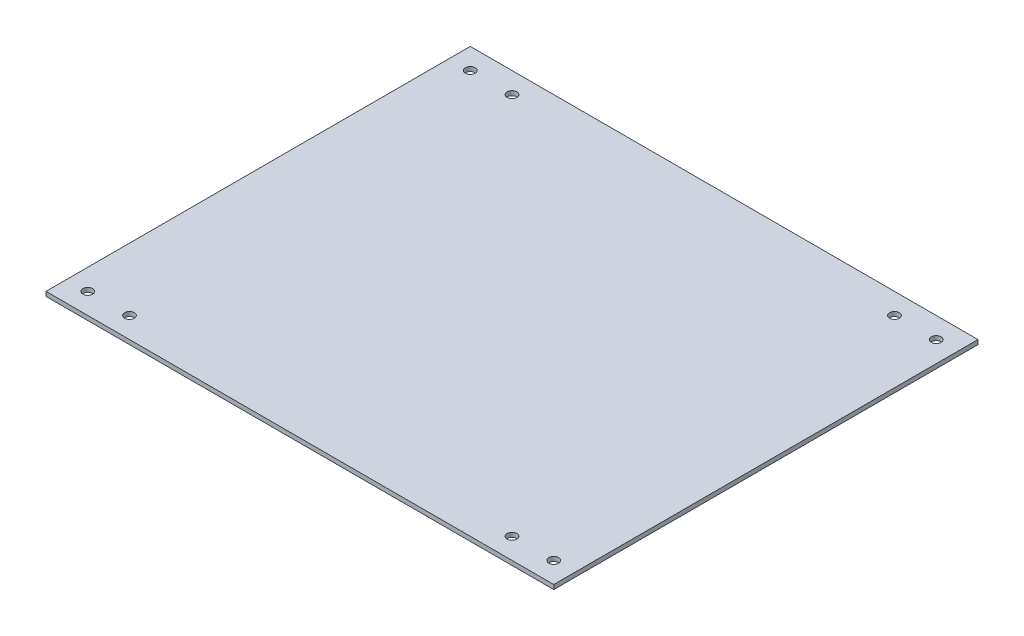
ISO-10303-21;
HEADER;
FILE_DESCRIPTION(('STEP AP214'),'2;1');
FILE_NAME('part.step','',(''),(''),'','','');
FILE_SCHEMA(('AUTOMOTIVE_DESIGN { 1 0 10303 214 1 1 1 1 }'));
ENDSEC;
DATA;
#1=APPLICATION_CONTEXT('core data for automotive mechanical design processes');
#2=APPLICATION_PROTOCOL_DEFINITION('international standard','automotive_design',2000,#1);
#3=PRODUCT_CONTEXT('',#1,'mechanical');
#4=PRODUCT('Part','Part','',(#3));
#5=PRODUCT_RELATED_PRODUCT_CATEGORY('part','',(#4));
#6=PRODUCT_DEFINITION_FORMATION('','',#4);
#7=PRODUCT_DEFINITION_CONTEXT('part definition',#1,'design');
#8=PRODUCT_DEFINITION('design','',#6,#7);
#9=PRODUCT_DEFINITION_SHAPE('','',#8);
#10=(LENGTH_UNIT() NAMED_UNIT(*) SI_UNIT(.MILLI.,.METRE.));
#11=(NAMED_UNIT(*) PLANE_ANGLE_UNIT() SI_UNIT($,.RADIAN.));
#12=(NAMED_UNIT(*) SI_UNIT($,.STERADIAN.) SOLID_ANGLE_UNIT());
#13=UNCERTAINTY_MEASURE_WITH_UNIT(LENGTH_MEASURE(1.E-05),#10,'distance_accuracy_value','');
#14=(GEOMETRIC_REPRESENTATION_CONTEXT(3) GLOBAL_UNCERTAINTY_ASSIGNED_CONTEXT((#13)) GLOBAL_UNIT_ASSIGNED_CONTEXT((#10,
#11,#12)) REPRESENTATION_CONTEXT('',''));
#15=CARTESIAN_POINT('',(0.,0.,0.));
#16=DIRECTION('',(0.,0.,1.));
#17=DIRECTION('',(1.,0.,0.));
#18=AXIS2_PLACEMENT_3D('',#15,#16,#17);
#19=CARTESIAN_POINT('',(0.,3.175,0.));
#20=DIRECTION('',(1.,0.,0.));
#21=DIRECTION('',(0.,0.,-1.));
#22=AXIS2_PLACEMENT_3D('',#19,#20,#21);
#23=PLANE('',#22);
#24=DIRECTION('',(0.,0.,1.));
#25=VECTOR('',#24,1.);
#26=CARTESIAN_POINT('',(0.,0.,0.));
#27=LINE('',#26,#25);
#28=CARTESIAN_POINT('',(0.,0.,-304.8));
#29=VERTEX_POINT('',#28);
#30=CARTESIAN_POINT('',(0.,0.,0.));
#31=VERTEX_POINT('',#30);
#32=EDGE_CURVE('E113',#29,#31,#27,.T.);
#33=ORIENTED_EDGE('',*,*,#32,.T.);
#34=DIRECTION('',(0.,-1.,0.));
#35=VECTOR('',#34,1.);
#36=CARTESIAN_POINT('',(0.,3.175,0.));
#37=LINE('',#36,#35);
#38=CARTESIAN_POINT('',(0.,3.175,0.));
#39=VERTEX_POINT('',#38);
#40=EDGE_CURVE('E11',#39,#31,#37,.T.);
#41=ORIENTED_EDGE('',*,*,#40,.F.);
#42=DIRECTION('',(0.,0.,1.));
#43=VECTOR('',#42,1.);
#44=CARTESIAN_POINT('',(0.,3.175,0.));
#45=LINE('',#44,#43);
#46=CARTESIAN_POINT('',(0.,3.175,-304.8));
#47=VERTEX_POINT('',#46);
#48=EDGE_CURVE('E97',#47,#39,#45,.T.);
#49=ORIENTED_EDGE('',*,*,#48,.F.);
#50=DIRECTION('',(0.,-1.,0.));
#51=VECTOR('',#50,1.);
#52=CARTESIAN_POINT('',(0.,3.175,-304.8));
#53=LINE('',#52,#51);
#54=EDGE_CURVE('E109',#47,#29,#53,.T.);
#55=ORIENTED_EDGE('',*,*,#54,.T.);
#56=EDGE_LOOP('',(#33,#41,#49,#55));
#57=FACE_BOUND('',#56,.T.);
#58=ADVANCED_FACE('F45',(#57),#23,.F.);
#59=CARTESIAN_POINT('',(0.,3.175,0.));
#60=DIRECTION('',(0.,0.,-1.));
#61=DIRECTION('',(-1.,0.,0.));
#62=AXIS2_PLACEMENT_3D('',#59,#60,#61);
#63=PLANE('',#62);
#64=DIRECTION('',(1.,0.,0.));
#65=VECTOR('',#64,1.);
#66=CARTESIAN_POINT('',(0.,0.,0.));
#67=LINE('',#66,#65);
#68=CARTESIAN_POINT('',(364.8,0.,0.));
#69=VERTEX_POINT('',#68);
#70=EDGE_CURVE('E102',#31,#69,#67,.T.);
#71=ORIENTED_EDGE('',*,*,#70,.T.);
#72=DIRECTION('',(0.,-1.,0.));
#73=VECTOR('',#72,1.);
#74=CARTESIAN_POINT('',(364.8,3.175,0.));
#75=LINE('',#74,#73);
#76=CARTESIAN_POINT('',(364.8,3.175,0.));
#77=VERTEX_POINT('',#76);
#78=EDGE_CURVE('E54',#77,#69,#75,.T.);
#79=ORIENTED_EDGE('',*,*,#78,.F.);
#80=DIRECTION('',(1.,0.,0.));
#81=VECTOR('',#80,1.);
#82=CARTESIAN_POINT('',(0.,3.175,0.));
#83=LINE('',#82,#81);
#84=EDGE_CURVE('E92',#39,#77,#83,.T.);
#85=ORIENTED_EDGE('',*,*,#84,.F.);
#86=ORIENTED_EDGE('',*,*,#40,.T.);
#87=EDGE_LOOP('',(#71,#79,#85,#86));
#88=FACE_BOUND('',#87,.T.);
#89=ADVANCED_FACE('F101',(#88),#63,.F.);
#90=CARTESIAN_POINT('',(364.8,3.175,0.));
#91=DIRECTION('',(-1.,0.,0.));
#92=DIRECTION('',(0.,0.,1.));
#93=AXIS2_PLACEMENT_3D('',#90,#91,#92);
#94=PLANE('',#93);
#95=DIRECTION('',(0.,0.,-1.));
#96=VECTOR('',#95,1.);
#97=CARTESIAN_POINT('',(364.8,0.,0.));
#98=LINE('',#97,#96);
#99=CARTESIAN_POINT('',(364.8,0.,-304.8));
#100=VERTEX_POINT('',#99);
#101=EDGE_CURVE('E79',#69,#100,#98,.T.);
#102=ORIENTED_EDGE('',*,*,#101,.T.);
#103=DIRECTION('',(0.,-1.,0.));
#104=VECTOR('',#103,1.);
#105=CARTESIAN_POINT('',(364.8,3.175,-304.8));
#106=LINE('',#105,#104);
#107=CARTESIAN_POINT('',(364.8,3.175,-304.8));
#108=VERTEX_POINT('',#107);
#109=EDGE_CURVE('E104',#108,#100,#106,.T.);
#110=ORIENTED_EDGE('',*,*,#109,.F.);
#111=DIRECTION('',(0.,0.,-1.));
#112=VECTOR('',#111,1.);
#113=CARTESIAN_POINT('',(364.8,3.175,0.));
#114=LINE('',#113,#112);
#115=EDGE_CURVE('E95',#77,#108,#114,.T.);
#116=ORIENTED_EDGE('',*,*,#115,.F.);
#117=ORIENTED_EDGE('',*,*,#78,.T.);
#118=EDGE_LOOP('',(#102,#110,#116,#117));
#119=FACE_BOUND('',#118,.T.);
#120=ADVANCED_FACE('F105',(#119),#94,.F.);
#121=CARTESIAN_POINT('',(0.,3.175,-304.8));
#122=DIRECTION('',(0.,0.,1.));
#123=DIRECTION('',(1.,0.,0.));
#124=AXIS2_PLACEMENT_3D('',#121,#122,#123);
#125=PLANE('',#124);
#126=DIRECTION('',(-1.,0.,0.));
#127=VECTOR('',#126,1.);
#128=CARTESIAN_POINT('',(0.,0.,-304.8));
#129=LINE('',#128,#127);
#130=EDGE_CURVE('E85',#100,#29,#129,.T.);
#131=ORIENTED_EDGE('',*,*,#130,.T.);
#132=ORIENTED_EDGE('',*,*,#54,.F.);
#133=DIRECTION('',(-1.,0.,0.));
#134=VECTOR('',#133,1.);
#135=CARTESIAN_POINT('',(0.,3.175,-304.8));
#136=LINE('',#135,#134);
#137=EDGE_CURVE('E62',#108,#47,#136,.T.);
#138=ORIENTED_EDGE('',*,*,#137,.F.);
#139=ORIENTED_EDGE('',*,*,#109,.T.);
#140=EDGE_LOOP('',(#131,#132,#138,#139));
#141=FACE_BOUND('',#140,.T.);
#142=ADVANCED_FACE('F127',(#141),#125,.F.);
#143=CARTESIAN_POINT('',(0.,3.175,0.));
#144=DIRECTION('',(0.,-1.,0.));
#145=DIRECTION('',(0.,0.,-1.));
#146=AXIS2_PLACEMENT_3D('',#143,#144,#145);
#147=PLANE('',#146);
#148=CARTESIAN_POINT('',(15.,3.175,-289.8));
#149=DIRECTION('',(0.,1.,0.));
#150=DIRECTION('',(0.,0.,1.));
#151=AXIS2_PLACEMENT_3D('',#148,#149,#150);
#152=CIRCLE('',#151,3.50000000000001);
#153=CARTESIAN_POINT('',(15.,3.175,-286.3));
#154=VERTEX_POINT('',#153);
#155=EDGE_CURVE('E193',#154,#154,#152,.T.);
#156=ORIENTED_EDGE('',*,*,#155,.F.);
#157=EDGE_LOOP('',(#156));
#158=FACE_BOUND('',#157,.T.);
#159=CARTESIAN_POINT('',(349.8,3.175,-289.8));
#160=DIRECTION('',(0.,1.,0.));
#161=DIRECTION('',(0.,0.,1.));
#162=AXIS2_PLACEMENT_3D('',#159,#160,#161);
#163=CIRCLE('',#162,3.5);
#164=CARTESIAN_POINT('',(349.8,3.175,-286.3));
#165=VERTEX_POINT('',#164);
#166=EDGE_CURVE('E185',#165,#165,#163,.T.);
#167=ORIENTED_EDGE('',*,*,#166,.F.);
#168=EDGE_LOOP('',(#167));
#169=FACE_BOUND('',#168,.T.);
#170=CARTESIAN_POINT('',(349.8,3.175,-15.));
#171=DIRECTION('',(0.,1.,0.));
#172=DIRECTION('',(0.,0.,1.));
#173=AXIS2_PLACEMENT_3D('',#170,#171,#172);
#174=CIRCLE('',#173,3.5);
#175=CARTESIAN_POINT('',(349.8,3.175,-11.5));
#176=VERTEX_POINT('',#175);
#177=EDGE_CURVE('E177',#176,#176,#174,.T.);
#178=ORIENTED_EDGE('',*,*,#177,.F.);
#179=EDGE_LOOP('',(#178));
#180=FACE_BOUND('',#179,.T.);
#181=CARTESIAN_POINT('',(15.,3.175,-15.));
#182=DIRECTION('',(0.,1.,0.));
#183=DIRECTION('',(0.,0.,1.));
#184=AXIS2_PLACEMENT_3D('',#181,#182,#183);
#185=CIRCLE('',#184,3.50000000000001);
#186=CARTESIAN_POINT('',(15.,3.175,-11.5));
#187=VERTEX_POINT('',#186);
#188=EDGE_CURVE('E169',#187,#187,#185,.T.);
#189=ORIENTED_EDGE('',*,*,#188,.F.);
#190=EDGE_LOOP('',(#189));
#191=FACE_BOUND('',#190,.T.);
#192=CARTESIAN_POINT('',(45.,3.175,-289.8));
#193=DIRECTION('',(0.,1.,0.));
#194=DIRECTION('',(0.,0.,1.));
#195=AXIS2_PLACEMENT_3D('',#192,#193,#194);
#196=CIRCLE('',#195,3.50000000000001);
#197=CARTESIAN_POINT('',(45.,3.175,-286.3));
#198=VERTEX_POINT('',#197);
#199=EDGE_CURVE('E161',#198,#198,#196,.T.);
#200=ORIENTED_EDGE('',*,*,#199,.F.);
#201=EDGE_LOOP('',(#200));
#202=FACE_BOUND('',#201,.T.);
#203=CARTESIAN_POINT('',(319.8,3.175,-289.8));
#204=DIRECTION('',(0.,1.,0.));
#205=DIRECTION('',(0.,0.,1.));
#206=AXIS2_PLACEMENT_3D('',#203,#204,#205);
#207=CIRCLE('',#206,3.5);
#208=CARTESIAN_POINT('',(319.8,3.175,-286.3));
#209=VERTEX_POINT('',#208);
#210=EDGE_CURVE('E153',#209,#209,#207,.T.);
#211=ORIENTED_EDGE('',*,*,#210,.F.);
#212=EDGE_LOOP('',(#211));
#213=FACE_BOUND('',#212,.T.);
#214=CARTESIAN_POINT('',(319.8,3.175,-15.));
#215=DIRECTION('',(0.,1.,0.));
#216=DIRECTION('',(0.,0.,1.));
#217=AXIS2_PLACEMENT_3D('',#214,#215,#216);
#218=CIRCLE('',#217,3.5);
#219=CARTESIAN_POINT('',(319.8,3.175,-11.5));
#220=VERTEX_POINT('',#219);
#221=EDGE_CURVE('E145',#220,#220,#218,.T.);
#222=ORIENTED_EDGE('',*,*,#221,.F.);
#223=EDGE_LOOP('',(#222));
#224=FACE_BOUND('',#223,.T.);
#225=CARTESIAN_POINT('',(45.,3.175,-15.));
#226=DIRECTION('',(0.,1.,0.));
#227=DIRECTION('',(0.,0.,1.));
#228=AXIS2_PLACEMENT_3D('',#225,#226,#227);
#229=CIRCLE('',#228,3.50000000000001);
#230=CARTESIAN_POINT('',(45.,3.175,-11.5));
#231=VERTEX_POINT('',#230);
#232=EDGE_CURVE('E137',#231,#231,#229,.T.);
#233=ORIENTED_EDGE('',*,*,#232,.F.);
#234=EDGE_LOOP('',(#233));
#235=FACE_BOUND('',#234,.T.);
#236=ORIENTED_EDGE('',*,*,#48,.T.);
#237=ORIENTED_EDGE('',*,*,#84,.T.);
#238=ORIENTED_EDGE('',*,*,#115,.T.);
#239=ORIENTED_EDGE('',*,*,#137,.T.);
#240=EDGE_LOOP('',(#236,#237,#238,#239));
#241=FACE_BOUND('',#240,.T.);
#242=ADVANCED_FACE('F93',(#158,#169,#180,#191,#202,#213,#224,#235,#241),#147,.F.);
#243=CARTESIAN_POINT('',(0.,0.,0.));
#244=DIRECTION('',(0.,-1.,0.));
#245=DIRECTION('',(0.,0.,-1.));
#246=AXIS2_PLACEMENT_3D('',#243,#244,#245);
#247=PLANE('',#246);
#248=CARTESIAN_POINT('',(15.,0.,-289.8));
#249=DIRECTION('',(0.,1.,0.));
#250=DIRECTION('',(0.,0.,1.));
#251=AXIS2_PLACEMENT_3D('',#248,#249,#250);
#252=CIRCLE('',#251,3.50000000000001);
#253=CARTESIAN_POINT('',(15.,0.,-286.3));
#254=VERTEX_POINT('',#253);
#255=EDGE_CURVE('E189',#254,#254,#252,.T.);
#256=ORIENTED_EDGE('',*,*,#255,.T.);
#257=EDGE_LOOP('',(#256));
#258=FACE_BOUND('',#257,.T.);
#259=CARTESIAN_POINT('',(349.8,0.,-289.8));
#260=DIRECTION('',(0.,1.,0.));
#261=DIRECTION('',(0.,0.,1.));
#262=AXIS2_PLACEMENT_3D('',#259,#260,#261);
#263=CIRCLE('',#262,3.5);
#264=CARTESIAN_POINT('',(349.8,0.,-286.3));
#265=VERTEX_POINT('',#264);
#266=EDGE_CURVE('E181',#265,#265,#263,.T.);
#267=ORIENTED_EDGE('',*,*,#266,.T.);
#268=EDGE_LOOP('',(#267));
#269=FACE_BOUND('',#268,.T.);
#270=CARTESIAN_POINT('',(349.8,0.,-15.));
#271=DIRECTION('',(0.,1.,0.));
#272=DIRECTION('',(0.,0.,1.));
#273=AXIS2_PLACEMENT_3D('',#270,#271,#272);
#274=CIRCLE('',#273,3.5);
#275=CARTESIAN_POINT('',(349.8,0.,-11.5));
#276=VERTEX_POINT('',#275);
#277=EDGE_CURVE('E173',#276,#276,#274,.T.);
#278=ORIENTED_EDGE('',*,*,#277,.T.);
#279=EDGE_LOOP('',(#278));
#280=FACE_BOUND('',#279,.T.);
#281=CARTESIAN_POINT('',(15.,0.,-15.));
#282=DIRECTION('',(0.,1.,0.));
#283=DIRECTION('',(0.,0.,1.));
#284=AXIS2_PLACEMENT_3D('',#281,#282,#283);
#285=CIRCLE('',#284,3.50000000000001);
#286=CARTESIAN_POINT('',(15.,0.,-11.5));
#287=VERTEX_POINT('',#286);
#288=EDGE_CURVE('E165',#287,#287,#285,.T.);
#289=ORIENTED_EDGE('',*,*,#288,.T.);
#290=EDGE_LOOP('',(#289));
#291=FACE_BOUND('',#290,.T.);
#292=CARTESIAN_POINT('',(45.,0.,-289.8));
#293=DIRECTION('',(0.,1.,0.));
#294=DIRECTION('',(0.,0.,1.));
#295=AXIS2_PLACEMENT_3D('',#292,#293,#294);
#296=CIRCLE('',#295,3.50000000000001);
#297=CARTESIAN_POINT('',(45.,0.,-286.3));
#298=VERTEX_POINT('',#297);
#299=EDGE_CURVE('E157',#298,#298,#296,.T.);
#300=ORIENTED_EDGE('',*,*,#299,.T.);
#301=EDGE_LOOP('',(#300));
#302=FACE_BOUND('',#301,.T.);
#303=CARTESIAN_POINT('',(319.8,0.,-289.8));
#304=DIRECTION('',(0.,1.,0.));
#305=DIRECTION('',(0.,0.,1.));
#306=AXIS2_PLACEMENT_3D('',#303,#304,#305);
#307=CIRCLE('',#306,3.5);
#308=CARTESIAN_POINT('',(319.8,0.,-286.3));
#309=VERTEX_POINT('',#308);
#310=EDGE_CURVE('E149',#309,#309,#307,.T.);
#311=ORIENTED_EDGE('',*,*,#310,.T.);
#312=EDGE_LOOP('',(#311));
#313=FACE_BOUND('',#312,.T.);
#314=CARTESIAN_POINT('',(319.8,0.,-15.));
#315=DIRECTION('',(0.,1.,0.));
#316=DIRECTION('',(0.,0.,1.));
#317=AXIS2_PLACEMENT_3D('',#314,#315,#316);
#318=CIRCLE('',#317,3.5);
#319=CARTESIAN_POINT('',(319.8,0.,-11.5));
#320=VERTEX_POINT('',#319);
#321=EDGE_CURVE('E141',#320,#320,#318,.T.);
#322=ORIENTED_EDGE('',*,*,#321,.T.);
#323=EDGE_LOOP('',(#322));
#324=FACE_BOUND('',#323,.T.);
#325=CARTESIAN_POINT('',(45.,0.,-15.));
#326=DIRECTION('',(0.,1.,0.));
#327=DIRECTION('',(0.,0.,1.));
#328=AXIS2_PLACEMENT_3D('',#325,#326,#327);
#329=CIRCLE('',#328,3.50000000000001);
#330=CARTESIAN_POINT('',(45.,0.,-11.5));
#331=VERTEX_POINT('',#330);
#332=EDGE_CURVE('E117',#331,#331,#329,.T.);
#333=ORIENTED_EDGE('',*,*,#332,.T.);
#334=EDGE_LOOP('',(#333));
#335=FACE_BOUND('',#334,.T.);
#336=ORIENTED_EDGE('',*,*,#32,.F.);
#337=ORIENTED_EDGE('',*,*,#130,.F.);
#338=ORIENTED_EDGE('',*,*,#101,.F.);
#339=ORIENTED_EDGE('',*,*,#70,.F.);
#340=EDGE_LOOP('',(#336,#337,#338,#339));
#341=FACE_BOUND('',#340,.T.);
#342=ADVANCED_FACE('F130',(#258,#269,#280,#291,#302,#313,#324,#335,#341),#247,.T.);
#343=CARTESIAN_POINT('',(45.,3.175,-15.));
#344=DIRECTION('',(0.,1.,0.));
#345=DIRECTION('',(0.,0.,1.));
#346=AXIS2_PLACEMENT_3D('',#343,#344,#345);
#347=CYLINDRICAL_SURFACE('',#346,3.50000000000001);
#348=ORIENTED_EDGE('',*,*,#332,.F.);
#349=EDGE_LOOP('',(#348));
#350=FACE_BOUND('',#349,.T.);
#351=ORIENTED_EDGE('',*,*,#232,.T.);
#352=EDGE_LOOP('',(#351));
#353=FACE_BOUND('',#352,.T.);
#354=ADVANCED_FACE('F217',(#350,#353),#347,.F.);
#355=CARTESIAN_POINT('',(319.8,3.175,-15.));
#356=DIRECTION('',(0.,1.,0.));
#357=DIRECTION('',(0.,0.,1.));
#358=AXIS2_PLACEMENT_3D('',#355,#356,#357);
#359=CYLINDRICAL_SURFACE('',#358,3.5);
#360=ORIENTED_EDGE('',*,*,#321,.F.);
#361=EDGE_LOOP('',(#360));
#362=FACE_BOUND('',#361,.T.);
#363=ORIENTED_EDGE('',*,*,#221,.T.);
#364=EDGE_LOOP('',(#363));
#365=FACE_BOUND('',#364,.T.);
#366=ADVANCED_FACE('F219',(#362,#365),#359,.F.);
#367=CARTESIAN_POINT('',(319.8,3.175,-289.8));
#368=DIRECTION('',(0.,1.,0.));
#369=DIRECTION('',(0.,0.,1.));
#370=AXIS2_PLACEMENT_3D('',#367,#368,#369);
#371=CYLINDRICAL_SURFACE('',#370,3.5);
#372=ORIENTED_EDGE('',*,*,#310,.F.);
#373=EDGE_LOOP('',(#372));
#374=FACE_BOUND('',#373,.T.);
#375=ORIENTED_EDGE('',*,*,#210,.T.);
#376=EDGE_LOOP('',(#375));
#377=FACE_BOUND('',#376,.T.);
#378=ADVANCED_FACE('F226',(#374,#377),#371,.F.);
#379=CARTESIAN_POINT('',(45.,3.175,-289.8));
#380=DIRECTION('',(0.,1.,0.));
#381=DIRECTION('',(0.,0.,1.));
#382=AXIS2_PLACEMENT_3D('',#379,#380,#381);
#383=CYLINDRICAL_SURFACE('',#382,3.50000000000001);
#384=ORIENTED_EDGE('',*,*,#299,.F.);
#385=EDGE_LOOP('',(#384));
#386=FACE_BOUND('',#385,.T.);
#387=ORIENTED_EDGE('',*,*,#199,.T.);
#388=EDGE_LOOP('',(#387));
#389=FACE_BOUND('',#388,.T.);
#390=ADVANCED_FACE('F276',(#386,#389),#383,.F.);
#391=CARTESIAN_POINT('',(15.,3.175,-15.));
#392=DIRECTION('',(0.,1.,0.));
#393=DIRECTION('',(0.,0.,1.));
#394=AXIS2_PLACEMENT_3D('',#391,#392,#393);
#395=CYLINDRICAL_SURFACE('',#394,3.50000000000001);
#396=ORIENTED_EDGE('',*,*,#288,.F.);
#397=EDGE_LOOP('',(#396));
#398=FACE_BOUND('',#397,.T.);
#399=ORIENTED_EDGE('',*,*,#188,.T.);
#400=EDGE_LOOP('',(#399));
#401=FACE_BOUND('',#400,.T.);
#402=ADVANCED_FACE('F286',(#398,#401),#395,.F.);
#403=CARTESIAN_POINT('',(349.8,3.175,-15.));
#404=DIRECTION('',(0.,1.,0.));
#405=DIRECTION('',(0.,0.,1.));
#406=AXIS2_PLACEMENT_3D('',#403,#404,#405);
#407=CYLINDRICAL_SURFACE('',#406,3.5);
#408=ORIENTED_EDGE('',*,*,#277,.F.);
#409=EDGE_LOOP('',(#408));
#410=FACE_BOUND('',#409,.T.);
#411=ORIENTED_EDGE('',*,*,#177,.T.);
#412=EDGE_LOOP('',(#411));
#413=FACE_BOUND('',#412,.T.);
#414=ADVANCED_FACE('F296',(#410,#413),#407,.F.);
#415=CARTESIAN_POINT('',(349.8,3.175,-289.8));
#416=DIRECTION('',(0.,1.,0.));
#417=DIRECTION('',(0.,0.,1.));
#418=AXIS2_PLACEMENT_3D('',#415,#416,#417);
#419=CYLINDRICAL_SURFACE('',#418,3.5);
#420=ORIENTED_EDGE('',*,*,#266,.F.);
#421=EDGE_LOOP('',(#420));
#422=FACE_BOUND('',#421,.T.);
#423=ORIENTED_EDGE('',*,*,#166,.T.);
#424=EDGE_LOOP('',(#423));
#425=FACE_BOUND('',#424,.T.);
#426=ADVANCED_FACE('F306',(#422,#425),#419,.F.);
#427=CARTESIAN_POINT('',(15.,3.175,-289.8));
#428=DIRECTION('',(0.,1.,0.));
#429=DIRECTION('',(0.,0.,1.));
#430=AXIS2_PLACEMENT_3D('',#427,#428,#429);
#431=CYLINDRICAL_SURFACE('',#430,3.50000000000001);
#432=ORIENTED_EDGE('',*,*,#255,.F.);
#433=EDGE_LOOP('',(#432));
#434=FACE_BOUND('',#433,.T.);
#435=ORIENTED_EDGE('',*,*,#155,.T.);
#436=EDGE_LOOP('',(#435));
#437=FACE_BOUND('',#436,.T.);
#438=ADVANCED_FACE('F198',(#434,#437),#431,.F.);
#439=CLOSED_SHELL('',(#58,#89,#120,#142,#242,#342,#354,#366,#378,#390,#402,#414,#426,#438));
#440=MANIFOLD_SOLID_BREP('B2',#439);
#441=ADVANCED_BREP_SHAPE_REPRESENTATION('',(#18,#440),#14);
#442=SHAPE_DEFINITION_REPRESENTATION(#9,#441);
ENDSEC;
END-ISO-10303-21;
